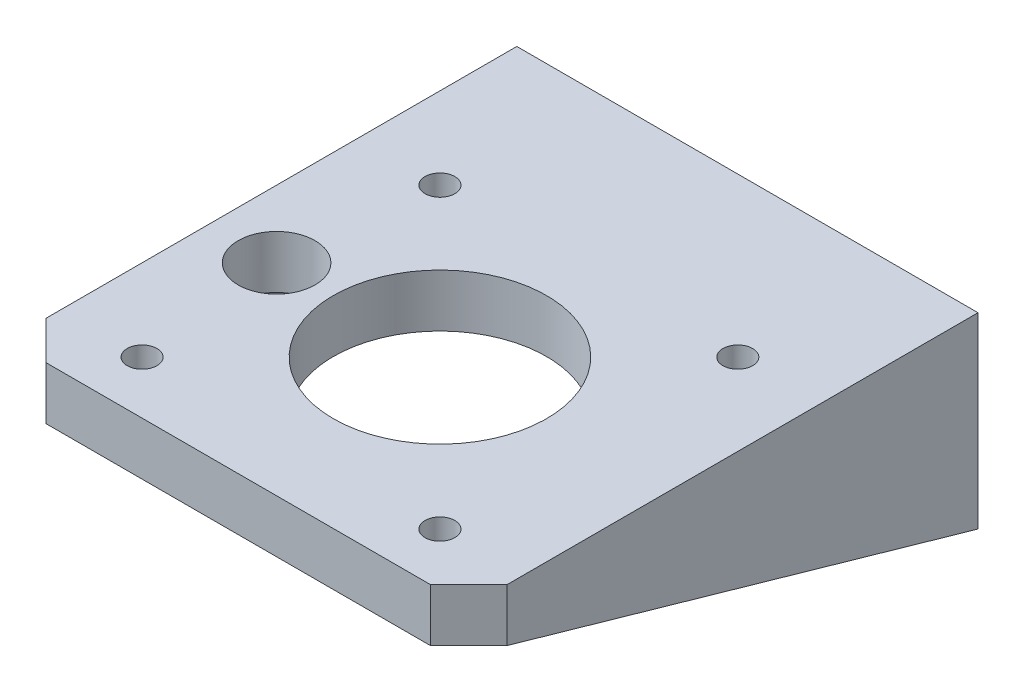
ISO-10303-21;
HEADER;
FILE_DESCRIPTION(('STEP AP214'),'2;1');
FILE_NAME('part.step','',(''),(''),'','','');
FILE_SCHEMA(('AUTOMOTIVE_DESIGN { 1 0 10303 214 1 1 1 1 }'));
ENDSEC;
DATA;
#1=APPLICATION_CONTEXT('core data for automotive mechanical design processes');
#2=APPLICATION_PROTOCOL_DEFINITION('international standard','automotive_design',2000,#1);
#3=PRODUCT_CONTEXT('',#1,'mechanical');
#4=PRODUCT('Part','Part','',(#3));
#5=PRODUCT_RELATED_PRODUCT_CATEGORY('part','',(#4));
#6=PRODUCT_DEFINITION_FORMATION('','',#4);
#7=PRODUCT_DEFINITION_CONTEXT('part definition',#1,'design');
#8=PRODUCT_DEFINITION('design','',#6,#7);
#9=PRODUCT_DEFINITION_SHAPE('','',#8);
#10=(LENGTH_UNIT() NAMED_UNIT(*) SI_UNIT(.MILLI.,.METRE.));
#11=(NAMED_UNIT(*) PLANE_ANGLE_UNIT() SI_UNIT($,.RADIAN.));
#12=(NAMED_UNIT(*) SI_UNIT($,.STERADIAN.) SOLID_ANGLE_UNIT());
#13=UNCERTAINTY_MEASURE_WITH_UNIT(LENGTH_MEASURE(1.E-05),#10,'distance_accuracy_value','');
#14=(GEOMETRIC_REPRESENTATION_CONTEXT(3) GLOBAL_UNCERTAINTY_ASSIGNED_CONTEXT((#13)) GLOBAL_UNIT_ASSIGNED_CONTEXT((#10,
#11,#12)) REPRESENTATION_CONTEXT('',''));
#15=CARTESIAN_POINT('',(0.,0.,0.));
#16=DIRECTION('',(0.,0.,1.));
#17=DIRECTION('',(1.,0.,0.));
#18=AXIS2_PLACEMENT_3D('',#15,#16,#17);
#19=CARTESIAN_POINT('',(-39.,-5.71428571428571,-57.3840620433566));
#20=DIRECTION('',(0.,0.,1.));
#21=DIRECTION('',(-1.,0.,0.));
#22=AXIS2_PLACEMENT_3D('',#19,#20,#21);
#23=CYLINDRICAL_SURFACE('',#22,1.55);
#24=CARTESIAN_POINT('',(-39.,-5.71428571428571,-53.));
#25=DIRECTION('',(0.,0.,-1.));
#26=DIRECTION('',(-1.,0.,0.));
#27=AXIS2_PLACEMENT_3D('',#24,#25,#26);
#28=CIRCLE('',#27,1.55);
#29=CARTESIAN_POINT('',(-40.55,-5.71428571428571,-53.));
#30=VERTEX_POINT('',#29);
#31=EDGE_CURVE('E319',#30,#30,#28,.F.);
#32=ORIENTED_EDGE('',*,*,#31,.F.);
#33=EDGE_LOOP('',(#32));
#34=FACE_BOUND('',#33,.T.);
#35=CARTESIAN_POINT('',(-39.,-5.71428571428571,-47.));
#36=DIRECTION('',(0.,0.,-1.));
#37=DIRECTION('',(-1.,0.,0.));
#38=AXIS2_PLACEMENT_3D('',#35,#36,#37);
#39=CIRCLE('',#38,1.55);
#40=CARTESIAN_POINT('',(-40.55,-5.71428571428571,-47.));
#41=VERTEX_POINT('',#40);
#42=EDGE_CURVE('E338',#41,#41,#39,.F.);
#43=ORIENTED_EDGE('',*,*,#42,.T.);
#44=EDGE_LOOP('',(#43));
#45=FACE_BOUND('',#44,.T.);
#46=ADVANCED_FACE('F35',(#34,#45),#23,.F.);
#47=CARTESIAN_POINT('',(-9.,-5.71428571428571,-57.3840620433566));
#48=DIRECTION('',(0.,0.,1.));
#49=DIRECTION('',(-1.,0.,0.));
#50=AXIS2_PLACEMENT_3D('',#47,#48,#49);
#51=CYLINDRICAL_SURFACE('',#50,1.55);
#52=CARTESIAN_POINT('',(-9.,-5.71428571428571,-53.));
#53=DIRECTION('',(0.,0.,-1.));
#54=DIRECTION('',(-1.,0.,0.));
#55=AXIS2_PLACEMENT_3D('',#52,#53,#54);
#56=CIRCLE('',#55,1.55);
#57=CARTESIAN_POINT('',(-10.55,-5.71428571428571,-53.));
#58=VERTEX_POINT('',#57);
#59=EDGE_CURVE('E145',#58,#58,#56,.F.);
#60=ORIENTED_EDGE('',*,*,#59,.F.);
#61=EDGE_LOOP('',(#60));
#62=FACE_BOUND('',#61,.T.);
#63=CARTESIAN_POINT('',(-9.,-5.71428571428571,-47.));
#64=DIRECTION('',(0.,0.,-1.));
#65=DIRECTION('',(-1.,0.,0.));
#66=AXIS2_PLACEMENT_3D('',#63,#64,#65);
#67=CIRCLE('',#66,1.55);
#68=CARTESIAN_POINT('',(-10.55,-5.71428571428571,-47.));
#69=VERTEX_POINT('',#68);
#70=EDGE_CURVE('E330',#69,#69,#67,.F.);
#71=ORIENTED_EDGE('',*,*,#70,.T.);
#72=EDGE_LOOP('',(#71));
#73=FACE_BOUND('',#72,.T.);
#74=ADVANCED_FACE('F258',(#62,#73),#51,.F.);
#75=CARTESIAN_POINT('',(0.,0.,0.));
#76=DIRECTION('',(0.,-1.,0.));
#77=DIRECTION('',(0.,0.,-1.));
#78=AXIS2_PLACEMENT_3D('',#75,#76,#77);
#79=PLANE('',#78);
#80=CARTESIAN_POINT('',(-24.,0.,-21.));
#81=DIRECTION('',(0.,-1.,0.));
#82=DIRECTION('',(0.,0.,1.));
#83=AXIS2_PLACEMENT_3D('',#80,#81,#82);
#84=CIRCLE('',#83,11.1);
#85=CARTESIAN_POINT('',(-24.,0.,-9.89999999999999));
#86=VERTEX_POINT('',#85);
#87=EDGE_CURVE('E173',#86,#86,#84,.T.);
#88=ORIENTED_EDGE('',*,*,#87,.F.);
#89=EDGE_LOOP('',(#88));
#90=FACE_BOUND('',#89,.T.);
#91=CARTESIAN_POINT('',(-8.5,0.,-5.5));
#92=DIRECTION('',(0.,-1.,0.));
#93=DIRECTION('',(0.,0.,1.));
#94=AXIS2_PLACEMENT_3D('',#91,#92,#93);
#95=CIRCLE('',#94,1.55);
#96=CARTESIAN_POINT('',(-8.5,0.,-3.95));
#97=VERTEX_POINT('',#96);
#98=EDGE_CURVE('E184',#97,#97,#95,.T.);
#99=ORIENTED_EDGE('',*,*,#98,.F.);
#100=EDGE_LOOP('',(#99));
#101=FACE_BOUND('',#100,.T.);
#102=CARTESIAN_POINT('',(-8.5,0.,-36.5));
#103=DIRECTION('',(0.,-1.,0.));
#104=DIRECTION('',(0.,0.,1.));
#105=AXIS2_PLACEMENT_3D('',#102,#103,#104);
#106=CIRCLE('',#105,1.55);
#107=CARTESIAN_POINT('',(-8.5,0.,-34.95));
#108=VERTEX_POINT('',#107);
#109=EDGE_CURVE('E196',#108,#108,#106,.T.);
#110=ORIENTED_EDGE('',*,*,#109,.F.);
#111=EDGE_LOOP('',(#110));
#112=FACE_BOUND('',#111,.T.);
#113=CARTESIAN_POINT('',(-39.5,0.,-36.5));
#114=DIRECTION('',(0.,-1.,0.));
#115=DIRECTION('',(0.,0.,1.));
#116=AXIS2_PLACEMENT_3D('',#113,#114,#115);
#117=CIRCLE('',#116,1.55);
#118=CARTESIAN_POINT('',(-39.5,0.,-34.95));
#119=VERTEX_POINT('',#118);
#120=EDGE_CURVE('E190',#119,#119,#117,.T.);
#121=ORIENTED_EDGE('',*,*,#120,.F.);
#122=EDGE_LOOP('',(#121));
#123=FACE_BOUND('',#122,.T.);
#124=CARTESIAN_POINT('',(-39.5,0.,-5.5));
#125=DIRECTION('',(0.,-1.,0.));
#126=DIRECTION('',(0.,0.,1.));
#127=AXIS2_PLACEMENT_3D('',#124,#125,#126);
#128=CIRCLE('',#127,1.55);
#129=CARTESIAN_POINT('',(-39.5,0.,-3.95));
#130=VERTEX_POINT('',#129);
#131=EDGE_CURVE('E178',#130,#130,#128,.T.);
#132=ORIENTED_EDGE('',*,*,#131,.F.);
#133=EDGE_LOOP('',(#132));
#134=FACE_BOUND('',#133,.T.);
#135=DIRECTION('',(0.,0.,-1.));
#136=VECTOR('',#135,1.);
#137=CARTESIAN_POINT('',(-3.,0.,0.));
#138=LINE('',#137,#136);
#139=CARTESIAN_POINT('',(-3.,0.,-4.));
#140=VERTEX_POINT('',#139);
#141=CARTESIAN_POINT('',(-3.,0.,-44.));
#142=VERTEX_POINT('',#141);
#143=EDGE_CURVE('E165',#140,#142,#138,.T.);
#144=ORIENTED_EDGE('',*,*,#143,.F.);
#145=DIRECTION('',(1.,0.,0.));
#146=VECTOR('',#145,1.);
#147=CARTESIAN_POINT('',(-3.,0.,-4.));
#148=LINE('',#147,#146);
#149=CARTESIAN_POINT('',(0.,0.,-4.));
#150=VERTEX_POINT('',#149);
#151=EDGE_CURVE('E162',#140,#150,#148,.T.);
#152=ORIENTED_EDGE('',*,*,#151,.T.);
#153=DIRECTION('',(-0.707106781186547,0.,0.707106781186548));
#154=VECTOR('',#153,1.);
#155=CARTESIAN_POINT('',(-4.,0.,0.));
#156=LINE('',#155,#154);
#157=CARTESIAN_POINT('',(-4.,0.,0.));
#158=VERTEX_POINT('',#157);
#159=EDGE_CURVE('E202',#150,#158,#156,.T.);
#160=ORIENTED_EDGE('',*,*,#159,.T.);
#161=DIRECTION('',(-1.,0.,0.));
#162=VECTOR('',#161,1.);
#163=CARTESIAN_POINT('',(-44.,0.,0.));
#164=LINE('',#163,#162);
#165=CARTESIAN_POINT('',(-44.,0.,0.));
#166=VERTEX_POINT('',#165);
#167=EDGE_CURVE('E222',#158,#166,#164,.T.);
#168=ORIENTED_EDGE('',*,*,#167,.T.);
#169=DIRECTION('',(-0.707106781186547,0.,-0.707106781186548));
#170=VECTOR('',#169,1.);
#171=CARTESIAN_POINT('',(-48.,0.,-4.));
#172=LINE('',#171,#170);
#173=CARTESIAN_POINT('',(-48.,0.,-4.00000000000001));
#174=VERTEX_POINT('',#173);
#175=EDGE_CURVE('E208',#166,#174,#172,.T.);
#176=ORIENTED_EDGE('',*,*,#175,.T.);
#177=DIRECTION('',(-1.,0.,0.));
#178=VECTOR('',#177,1.);
#179=CARTESIAN_POINT('',(-45.,0.,-4.00000000000001));
#180=LINE('',#179,#178);
#181=CARTESIAN_POINT('',(-45.,0.,-4.00000000000001));
#182=VERTEX_POINT('',#181);
#183=EDGE_CURVE('E134',#182,#174,#180,.T.);
#184=ORIENTED_EDGE('',*,*,#183,.F.);
#185=DIRECTION('',(0.,0.,1.));
#186=VECTOR('',#185,1.);
#187=CARTESIAN_POINT('',(-45.,0.,0.));
#188=LINE('',#187,#186);
#189=CARTESIAN_POINT('',(-45.,0.,-21.));
#190=VERTEX_POINT('',#189);
#191=EDGE_CURVE('E132',#190,#182,#188,.T.);
#192=ORIENTED_EDGE('',*,*,#191,.F.);
#193=CARTESIAN_POINT('',(-41.,0.,-21.));
#194=DIRECTION('',(0.,-1.,0.));
#195=DIRECTION('',(0.,0.,1.));
#196=AXIS2_PLACEMENT_3D('',#193,#194,#195);
#197=CIRCLE('',#196,4.00000000000001);
#198=EDGE_CURVE('E151',#190,#190,#197,.T.);
#199=ORIENTED_EDGE('',*,*,#198,.F.);
#200=CARTESIAN_POINT('',(-45.,0.,-44.));
#201=VERTEX_POINT('',#200);
#202=EDGE_CURVE('E148',#201,#190,#188,.T.);
#203=ORIENTED_EDGE('',*,*,#202,.F.);
#204=DIRECTION('',(1.,0.,0.));
#205=VECTOR('',#204,1.);
#206=CARTESIAN_POINT('',(-3.,0.,-44.));
#207=LINE('',#206,#205);
#208=EDGE_CURVE('E139',#201,#142,#207,.T.);
#209=ORIENTED_EDGE('',*,*,#208,.T.);
#210=EDGE_LOOP('',(#144,#152,#160,#168,#176,#184,#192,#199,#203,#209));
#211=FACE_BOUND('',#210,.T.);
#212=ADVANCED_FACE('F149',(#90,#101,#112,#123,#134,#211),#79,.T.);
#213=CARTESIAN_POINT('',(-3.,0.,0.));
#214=DIRECTION('',(1.,0.,0.));
#215=DIRECTION('',(0.,0.,1.));
#216=AXIS2_PLACEMENT_3D('',#213,#214,#215);
#217=PLANE('',#216);
#218=DIRECTION('',(0.,1.,0.));
#219=VECTOR('',#218,1.);
#220=CARTESIAN_POINT('',(-3.,-14.,-44.));
#221=LINE('',#220,#219);
#222=CARTESIAN_POINT('',(-3.,-11.4285714285714,-44.));
#223=VERTEX_POINT('',#222);
#224=EDGE_CURVE('E141',#223,#142,#221,.T.);
#225=ORIENTED_EDGE('',*,*,#224,.F.);
#226=DIRECTION('',(0.,0.274721127897378,0.961523947640823));
#227=VECTOR('',#226,1.);
#228=CARTESIAN_POINT('',(-3.,-14.,-53.));
#229=LINE('',#228,#227);
#230=EDGE_CURVE('E122',#223,#140,#229,.T.);
#231=ORIENTED_EDGE('',*,*,#230,.T.);
#232=ORIENTED_EDGE('',*,*,#143,.T.);
#233=EDGE_LOOP('',(#225,#231,#232));
#234=FACE_BOUND('',#233,.T.);
#235=ADVANCED_FACE('F277',(#234),#217,.F.);
#236=CARTESIAN_POINT('',(-45.,0.,0.));
#237=DIRECTION('',(-1.,0.,0.));
#238=DIRECTION('',(0.,0.,-1.));
#239=AXIS2_PLACEMENT_3D('',#236,#237,#238);
#240=PLANE('',#239);
#241=DIRECTION('',(0.,1.,0.));
#242=VECTOR('',#241,1.);
#243=CARTESIAN_POINT('',(-45.,0.,-44.));
#244=LINE('',#243,#242);
#245=CARTESIAN_POINT('',(-45.,-11.4285714285714,-44.));
#246=VERTEX_POINT('',#245);
#247=EDGE_CURVE('E11',#246,#201,#244,.T.);
#248=ORIENTED_EDGE('',*,*,#247,.T.);
#249=ORIENTED_EDGE('',*,*,#202,.T.);
#250=ORIENTED_EDGE('',*,*,#191,.T.);
#251=DIRECTION('',(0.,-0.274721127897378,-0.961523947640823));
#252=VECTOR('',#251,1.);
#253=CARTESIAN_POINT('',(-45.,-14.,-53.));
#254=LINE('',#253,#252);
#255=EDGE_CURVE('E120',#182,#246,#254,.T.);
#256=ORIENTED_EDGE('',*,*,#255,.T.);
#257=EDGE_LOOP('',(#248,#249,#250,#256));
#258=FACE_BOUND('',#257,.T.);
#259=ADVANCED_FACE('F129',(#258),#240,.F.);
#260=CARTESIAN_POINT('',(0.,5.5,0.));
#261=DIRECTION('',(0.,-1.,0.));
#262=DIRECTION('',(0.,0.,-1.));
#263=AXIS2_PLACEMENT_3D('',#260,#261,#262);
#264=PLANE('',#263);
#265=CARTESIAN_POINT('',(-41.,5.5,-21.));
#266=DIRECTION('',(0.,-1.,0.));
#267=DIRECTION('',(0.,0.,1.));
#268=AXIS2_PLACEMENT_3D('',#265,#266,#267);
#269=CIRCLE('',#268,4.00000000000001);
#270=CARTESIAN_POINT('',(-41.,5.5,-17.));
#271=VERTEX_POINT('',#270);
#272=EDGE_CURVE('E170',#271,#271,#269,.T.);
#273=ORIENTED_EDGE('',*,*,#272,.T.);
#274=EDGE_LOOP('',(#273));
#275=FACE_BOUND('',#274,.T.);
#276=DIRECTION('',(-0.707106781186547,0.,-0.707106781186548));
#277=VECTOR('',#276,1.);
#278=CARTESIAN_POINT('',(-48.,5.5,-4.));
#279=LINE('',#278,#277);
#280=CARTESIAN_POINT('',(-44.,5.5,0.));
#281=VERTEX_POINT('',#280);
#282=CARTESIAN_POINT('',(-48.,5.5,-4.));
#283=VERTEX_POINT('',#282);
#284=EDGE_CURVE('E212',#281,#283,#279,.T.);
#285=ORIENTED_EDGE('',*,*,#284,.F.);
#286=DIRECTION('',(-1.,0.,0.));
#287=VECTOR('',#286,1.);
#288=CARTESIAN_POINT('',(-44.,5.5,0.));
#289=LINE('',#288,#287);
#290=CARTESIAN_POINT('',(-4.,5.5,0.));
#291=VERTEX_POINT('',#290);
#292=EDGE_CURVE('E210',#291,#281,#289,.T.);
#293=ORIENTED_EDGE('',*,*,#292,.F.);
#294=DIRECTION('',(-0.707106781186547,0.,0.707106781186548));
#295=VECTOR('',#294,1.);
#296=CARTESIAN_POINT('',(-4.,5.5,0.));
#297=LINE('',#296,#295);
#298=CARTESIAN_POINT('',(0.,5.5,-4.));
#299=VERTEX_POINT('',#298);
#300=EDGE_CURVE('E207',#299,#291,#297,.T.);
#301=ORIENTED_EDGE('',*,*,#300,.F.);
#302=DIRECTION('',(0.,0.,1.));
#303=VECTOR('',#302,1.);
#304=CARTESIAN_POINT('',(0.,5.5,-4.));
#305=LINE('',#304,#303);
#306=CARTESIAN_POINT('',(0.,5.5,-53.));
#307=VERTEX_POINT('',#306);
#308=EDGE_CURVE('E205',#307,#299,#305,.T.);
#309=ORIENTED_EDGE('',*,*,#308,.F.);
#310=DIRECTION('',(1.,0.,0.));
#311=VECTOR('',#310,1.);
#312=CARTESIAN_POINT('',(-4.,5.5,-53.));
#313=LINE('',#312,#311);
#314=CARTESIAN_POINT('',(-48.,5.5,-53.));
#315=VERTEX_POINT('',#314);
#316=EDGE_CURVE('E217',#315,#307,#313,.T.);
#317=ORIENTED_EDGE('',*,*,#316,.F.);
#318=DIRECTION('',(0.,0.,-1.));
#319=VECTOR('',#318,1.);
#320=CARTESIAN_POINT('',(-48.,5.5,-49.));
#321=LINE('',#320,#319);
#322=EDGE_CURVE('E215',#283,#315,#321,.T.);
#323=ORIENTED_EDGE('',*,*,#322,.F.);
#324=EDGE_LOOP('',(#285,#293,#301,#309,#317,#323));
#325=FACE_BOUND('',#324,.T.);
#326=CARTESIAN_POINT('',(-8.5,5.5,-36.5));
#327=DIRECTION('',(0.,-1.,0.));
#328=DIRECTION('',(0.,0.,1.));
#329=AXIS2_PLACEMENT_3D('',#326,#327,#328);
#330=CIRCLE('',#329,1.55);
#331=CARTESIAN_POINT('',(-8.5,5.5,-34.95));
#332=VERTEX_POINT('',#331);
#333=EDGE_CURVE('E199',#332,#332,#330,.T.);
#334=ORIENTED_EDGE('',*,*,#333,.T.);
#335=EDGE_LOOP('',(#334));
#336=FACE_BOUND('',#335,.T.);
#337=CARTESIAN_POINT('',(-39.5,5.5,-36.5));
#338=DIRECTION('',(0.,-1.,0.));
#339=DIRECTION('',(0.,0.,1.));
#340=AXIS2_PLACEMENT_3D('',#337,#338,#339);
#341=CIRCLE('',#340,1.55);
#342=CARTESIAN_POINT('',(-39.5,5.5,-34.95));
#343=VERTEX_POINT('',#342);
#344=EDGE_CURVE('E193',#343,#343,#341,.T.);
#345=ORIENTED_EDGE('',*,*,#344,.T.);
#346=EDGE_LOOP('',(#345));
#347=FACE_BOUND('',#346,.T.);
#348=CARTESIAN_POINT('',(-8.5,5.5,-5.5));
#349=DIRECTION('',(0.,-1.,0.));
#350=DIRECTION('',(0.,0.,1.));
#351=AXIS2_PLACEMENT_3D('',#348,#349,#350);
#352=CIRCLE('',#351,1.55);
#353=CARTESIAN_POINT('',(-8.5,5.5,-3.95));
#354=VERTEX_POINT('',#353);
#355=EDGE_CURVE('E187',#354,#354,#352,.T.);
#356=ORIENTED_EDGE('',*,*,#355,.T.);
#357=EDGE_LOOP('',(#356));
#358=FACE_BOUND('',#357,.T.);
#359=CARTESIAN_POINT('',(-39.5,5.5,-5.5));
#360=DIRECTION('',(0.,-1.,0.));
#361=DIRECTION('',(0.,0.,1.));
#362=AXIS2_PLACEMENT_3D('',#359,#360,#361);
#363=CIRCLE('',#362,1.55);
#364=CARTESIAN_POINT('',(-39.5,5.5,-3.95));
#365=VERTEX_POINT('',#364);
#366=EDGE_CURVE('E181',#365,#365,#363,.T.);
#367=ORIENTED_EDGE('',*,*,#366,.T.);
#368=EDGE_LOOP('',(#367));
#369=FACE_BOUND('',#368,.T.);
#370=CARTESIAN_POINT('',(-24.,5.5,-21.));
#371=DIRECTION('',(0.,-1.,0.));
#372=DIRECTION('',(0.,0.,1.));
#373=AXIS2_PLACEMENT_3D('',#370,#371,#372);
#374=CIRCLE('',#373,11.1);
#375=CARTESIAN_POINT('',(-24.,5.5,-9.89999999999999));
#376=VERTEX_POINT('',#375);
#377=EDGE_CURVE('E175',#376,#376,#374,.T.);
#378=ORIENTED_EDGE('',*,*,#377,.T.);
#379=EDGE_LOOP('',(#378));
#380=FACE_BOUND('',#379,.T.);
#381=ADVANCED_FACE('F242',(#275,#325,#336,#347,#358,#369,#380),#264,.F.);
#382=CARTESIAN_POINT('',(0.,5.5,-4.));
#383=DIRECTION('',(-1.,0.,0.));
#384=DIRECTION('',(0.,0.,-1.));
#385=AXIS2_PLACEMENT_3D('',#382,#383,#384);
#386=PLANE('',#385);
#387=DIRECTION('',(0.,1.,0.));
#388=VECTOR('',#387,1.);
#389=CARTESIAN_POINT('',(0.,0.,-53.));
#390=LINE('',#389,#388);
#391=CARTESIAN_POINT('',(0.,-14.,-53.));
#392=VERTEX_POINT('',#391);
#393=EDGE_CURVE('E168',#392,#307,#390,.T.);
#394=ORIENTED_EDGE('',*,*,#393,.T.);
#395=ORIENTED_EDGE('',*,*,#308,.T.);
#396=DIRECTION('',(0.,-1.,0.));
#397=VECTOR('',#396,1.);
#398=CARTESIAN_POINT('',(0.,5.5,-4.));
#399=LINE('',#398,#397);
#400=EDGE_CURVE('E44',#299,#150,#399,.T.);
#401=ORIENTED_EDGE('',*,*,#400,.T.);
#402=DIRECTION('',(0.,0.274721127897378,0.961523947640823));
#403=VECTOR('',#402,1.);
#404=CARTESIAN_POINT('',(0.,-14.,-53.));
#405=LINE('',#404,#403);
#406=EDGE_CURVE('E154',#392,#150,#405,.T.);
#407=ORIENTED_EDGE('',*,*,#406,.F.);
#408=EDGE_LOOP('',(#394,#395,#401,#407));
#409=FACE_BOUND('',#408,.T.);
#410=ADVANCED_FACE('F37',(#409),#386,.F.);
#411=CARTESIAN_POINT('',(-4.,5.5,0.));
#412=DIRECTION('',(-0.707106781186548,0.,-0.707106781186547));
#413=DIRECTION('',(0.707106781186547,0.,-0.707106781186548));
#414=AXIS2_PLACEMENT_3D('',#411,#412,#413);
#415=PLANE('',#414);
#416=ORIENTED_EDGE('',*,*,#159,.F.);
#417=ORIENTED_EDGE('',*,*,#400,.F.);
#418=ORIENTED_EDGE('',*,*,#300,.T.);
#419=DIRECTION('',(0.,-1.,0.));
#420=VECTOR('',#419,1.);
#421=CARTESIAN_POINT('',(-4.,5.5,0.));
#422=LINE('',#421,#420);
#423=EDGE_CURVE('E68',#291,#158,#422,.T.);
#424=ORIENTED_EDGE('',*,*,#423,.T.);
#425=EDGE_LOOP('',(#416,#417,#418,#424));
#426=FACE_BOUND('',#425,.T.);
#427=ADVANCED_FACE('F234',(#426),#415,.F.);
#428=CARTESIAN_POINT('',(-44.,5.5,0.));
#429=DIRECTION('',(0.,0.,-1.));
#430=DIRECTION('',(1.,0.,0.));
#431=AXIS2_PLACEMENT_3D('',#428,#429,#430);
#432=PLANE('',#431);
#433=ORIENTED_EDGE('',*,*,#167,.F.);
#434=ORIENTED_EDGE('',*,*,#423,.F.);
#435=ORIENTED_EDGE('',*,*,#292,.T.);
#436=DIRECTION('',(0.,-1.,0.));
#437=VECTOR('',#436,1.);
#438=CARTESIAN_POINT('',(-44.,5.5,0.));
#439=LINE('',#438,#437);
#440=EDGE_CURVE('E74',#281,#166,#439,.T.);
#441=ORIENTED_EDGE('',*,*,#440,.T.);
#442=EDGE_LOOP('',(#433,#434,#435,#441));
#443=FACE_BOUND('',#442,.T.);
#444=ADVANCED_FACE('F245',(#443),#432,.F.);
#445=CARTESIAN_POINT('',(-48.,5.5,-4.));
#446=DIRECTION('',(0.707106781186548,0.,-0.707106781186547));
#447=DIRECTION('',(0.707106781186547,0.,0.707106781186548));
#448=AXIS2_PLACEMENT_3D('',#445,#446,#447);
#449=PLANE('',#448);
#450=ORIENTED_EDGE('',*,*,#175,.F.);
#451=ORIENTED_EDGE('',*,*,#440,.F.);
#452=ORIENTED_EDGE('',*,*,#284,.T.);
#453=DIRECTION('',(0.,-1.,0.));
#454=VECTOR('',#453,1.);
#455=CARTESIAN_POINT('',(-48.,5.5,-4.));
#456=LINE('',#455,#454);
#457=EDGE_CURVE('E52',#283,#174,#456,.T.);
#458=ORIENTED_EDGE('',*,*,#457,.T.);
#459=EDGE_LOOP('',(#450,#451,#452,#458));
#460=FACE_BOUND('',#459,.T.);
#461=ADVANCED_FACE('F247',(#460),#449,.F.);
#462=CARTESIAN_POINT('',(-48.,5.5,-49.));
#463=DIRECTION('',(1.,0.,0.));
#464=DIRECTION('',(0.,0.,1.));
#465=AXIS2_PLACEMENT_3D('',#462,#463,#464);
#466=PLANE('',#465);
#467=ORIENTED_EDGE('',*,*,#457,.F.);
#468=ORIENTED_EDGE('',*,*,#322,.T.);
#469=DIRECTION('',(0.,1.,0.));
#470=VECTOR('',#469,1.);
#471=CARTESIAN_POINT('',(-48.,0.,-53.));
#472=LINE('',#471,#470);
#473=CARTESIAN_POINT('',(-48.,-14.,-53.));
#474=VERTEX_POINT('',#473);
#475=EDGE_CURVE('E152',#474,#315,#472,.T.);
#476=ORIENTED_EDGE('',*,*,#475,.F.);
#477=DIRECTION('',(0.,-0.274721127897378,-0.961523947640823));
#478=VECTOR('',#477,1.);
#479=CARTESIAN_POINT('',(-48.,-14.,-53.));
#480=LINE('',#479,#478);
#481=EDGE_CURVE('E135',#174,#474,#480,.T.);
#482=ORIENTED_EDGE('',*,*,#481,.F.);
#483=EDGE_LOOP('',(#467,#468,#476,#482));
#484=FACE_BOUND('',#483,.T.);
#485=ADVANCED_FACE('F249',(#484),#466,.F.);
#486=CARTESIAN_POINT('',(-4.,5.5,-53.));
#487=DIRECTION('',(0.,0.,1.));
#488=DIRECTION('',(-1.,0.,0.));
#489=AXIS2_PLACEMENT_3D('',#486,#487,#488);
#490=PLANE('',#489);
#491=ORIENTED_EDGE('',*,*,#31,.T.);
#492=EDGE_LOOP('',(#491));
#493=FACE_BOUND('',#492,.T.);
#494=ORIENTED_EDGE('',*,*,#59,.T.);
#495=EDGE_LOOP('',(#494));
#496=FACE_BOUND('',#495,.T.);
#497=ORIENTED_EDGE('',*,*,#475,.T.);
#498=ORIENTED_EDGE('',*,*,#316,.T.);
#499=ORIENTED_EDGE('',*,*,#393,.F.);
#500=DIRECTION('',(1.,0.,0.));
#501=VECTOR('',#500,1.);
#502=CARTESIAN_POINT('',(-3.,-14.,-53.));
#503=LINE('',#502,#501);
#504=EDGE_CURVE('E160',#474,#392,#503,.T.);
#505=ORIENTED_EDGE('',*,*,#504,.F.);
#506=EDGE_LOOP('',(#497,#498,#499,#505));
#507=FACE_BOUND('',#506,.T.);
#508=ADVANCED_FACE('F238',(#493,#496,#507),#490,.F.);
#509=CARTESIAN_POINT('',(-8.5,5.5,-36.5));
#510=DIRECTION('',(0.,-1.,0.));
#511=DIRECTION('',(0.,0.,-1.));
#512=AXIS2_PLACEMENT_3D('',#509,#510,#511);
#513=CYLINDRICAL_SURFACE('',#512,1.55);
#514=ORIENTED_EDGE('',*,*,#333,.F.);
#515=EDGE_LOOP('',(#514));
#516=FACE_BOUND('',#515,.T.);
#517=ORIENTED_EDGE('',*,*,#109,.T.);
#518=EDGE_LOOP('',(#517));
#519=FACE_BOUND('',#518,.T.);
#520=ADVANCED_FACE('F302',(#516,#519),#513,.F.);
#521=CARTESIAN_POINT('',(-39.5,5.5,-36.5));
#522=DIRECTION('',(0.,-1.,0.));
#523=DIRECTION('',(0.,0.,-1.));
#524=AXIS2_PLACEMENT_3D('',#521,#522,#523);
#525=CYLINDRICAL_SURFACE('',#524,1.55);
#526=ORIENTED_EDGE('',*,*,#344,.F.);
#527=EDGE_LOOP('',(#526));
#528=FACE_BOUND('',#527,.T.);
#529=ORIENTED_EDGE('',*,*,#120,.T.);
#530=EDGE_LOOP('',(#529));
#531=FACE_BOUND('',#530,.T.);
#532=ADVANCED_FACE('F298',(#528,#531),#525,.F.);
#533=CARTESIAN_POINT('',(-8.5,5.5,-5.5));
#534=DIRECTION('',(0.,-1.,0.));
#535=DIRECTION('',(0.,0.,-1.));
#536=AXIS2_PLACEMENT_3D('',#533,#534,#535);
#537=CYLINDRICAL_SURFACE('',#536,1.55);
#538=ORIENTED_EDGE('',*,*,#355,.F.);
#539=EDGE_LOOP('',(#538));
#540=FACE_BOUND('',#539,.T.);
#541=ORIENTED_EDGE('',*,*,#98,.T.);
#542=EDGE_LOOP('',(#541));
#543=FACE_BOUND('',#542,.T.);
#544=ADVANCED_FACE('F294',(#540,#543),#537,.F.);
#545=CARTESIAN_POINT('',(-39.5,5.5,-5.5));
#546=DIRECTION('',(0.,-1.,0.));
#547=DIRECTION('',(0.,0.,-1.));
#548=AXIS2_PLACEMENT_3D('',#545,#546,#547);
#549=CYLINDRICAL_SURFACE('',#548,1.55);
#550=ORIENTED_EDGE('',*,*,#366,.F.);
#551=EDGE_LOOP('',(#550));
#552=FACE_BOUND('',#551,.T.);
#553=ORIENTED_EDGE('',*,*,#131,.T.);
#554=EDGE_LOOP('',(#553));
#555=FACE_BOUND('',#554,.T.);
#556=ADVANCED_FACE('F290',(#552,#555),#549,.F.);
#557=CARTESIAN_POINT('',(-24.,5.5,-21.));
#558=DIRECTION('',(0.,-1.,0.));
#559=DIRECTION('',(0.,0.,-1.));
#560=AXIS2_PLACEMENT_3D('',#557,#558,#559);
#561=CYLINDRICAL_SURFACE('',#560,11.1);
#562=ORIENTED_EDGE('',*,*,#377,.F.);
#563=EDGE_LOOP('',(#562));
#564=FACE_BOUND('',#563,.T.);
#565=ORIENTED_EDGE('',*,*,#87,.T.);
#566=EDGE_LOOP('',(#565));
#567=FACE_BOUND('',#566,.T.);
#568=ADVANCED_FACE('F286',(#564,#567),#561,.F.);
#569=CARTESIAN_POINT('',(-41.,5.5,-21.));
#570=DIRECTION('',(0.,-1.,0.));
#571=DIRECTION('',(0.,0.,-1.));
#572=AXIS2_PLACEMENT_3D('',#569,#570,#571);
#573=CYLINDRICAL_SURFACE('',#572,4.00000000000001);
#574=ORIENTED_EDGE('',*,*,#198,.T.);
#575=EDGE_LOOP('',(#574));
#576=FACE_BOUND('',#575,.T.);
#577=ORIENTED_EDGE('',*,*,#272,.F.);
#578=EDGE_LOOP('',(#577));
#579=FACE_BOUND('',#578,.T.);
#580=ADVANCED_FACE('F283',(#576,#579),#573,.F.);
#581=CARTESIAN_POINT('',(-3.,-14.,-53.));
#582=DIRECTION('',(0.,-0.961523947640823,0.274721127897378));
#583=DIRECTION('',(0.,-0.274721127897378,-0.961523947640823));
#584=AXIS2_PLACEMENT_3D('',#581,#582,#583);
#585=PLANE('',#584);
#586=ORIENTED_EDGE('',*,*,#151,.F.);
#587=ORIENTED_EDGE('',*,*,#230,.F.);
#588=DIRECTION('',(1.,0.,0.));
#589=VECTOR('',#588,1.);
#590=CARTESIAN_POINT('',(-48.,-11.4285714285714,-44.));
#591=LINE('',#590,#589);
#592=EDGE_CURVE('E115',#246,#223,#591,.T.);
#593=ORIENTED_EDGE('',*,*,#592,.F.);
#594=ORIENTED_EDGE('',*,*,#255,.F.);
#595=ORIENTED_EDGE('',*,*,#183,.T.);
#596=ORIENTED_EDGE('',*,*,#481,.T.);
#597=ORIENTED_EDGE('',*,*,#504,.T.);
#598=ORIENTED_EDGE('',*,*,#406,.T.);
#599=EDGE_LOOP('',(#586,#587,#593,#594,#595,#596,#597,#598));
#600=FACE_BOUND('',#599,.T.);
#601=ADVANCED_FACE('F118',(#600),#585,.T.);
#602=CARTESIAN_POINT('',(-3.,-14.,-44.));
#603=DIRECTION('',(0.,0.,-1.));
#604=DIRECTION('',(1.,0.,0.));
#605=AXIS2_PLACEMENT_3D('',#602,#603,#604);
#606=PLANE('',#605);
#607=CARTESIAN_POINT('',(-39.,-5.71428571428571,-44.));
#608=DIRECTION('',(0.,0.,-1.));
#609=DIRECTION('',(-1.,0.,0.));
#610=AXIS2_PLACEMENT_3D('',#607,#608,#609);
#611=CIRCLE('',#610,2.85);
#612=CARTESIAN_POINT('',(-41.85,-5.71428571428571,-44.));
#613=VERTEX_POINT('',#612);
#614=EDGE_CURVE('E126',#613,#613,#611,.T.);
#615=ORIENTED_EDGE('',*,*,#614,.T.);
#616=EDGE_LOOP('',(#615));
#617=FACE_BOUND('',#616,.T.);
#618=CARTESIAN_POINT('',(-9.,-5.71428571428571,-44.));
#619=DIRECTION('',(0.,0.,-1.));
#620=DIRECTION('',(-1.,0.,0.));
#621=AXIS2_PLACEMENT_3D('',#618,#619,#620);
#622=CIRCLE('',#621,2.85);
#623=CARTESIAN_POINT('',(-11.85,-5.71428571428571,-44.));
#624=VERTEX_POINT('',#623);
#625=EDGE_CURVE('E327',#624,#624,#622,.T.);
#626=ORIENTED_EDGE('',*,*,#625,.T.);
#627=EDGE_LOOP('',(#626));
#628=FACE_BOUND('',#627,.T.);
#629=ORIENTED_EDGE('',*,*,#224,.T.);
#630=ORIENTED_EDGE('',*,*,#208,.F.);
#631=ORIENTED_EDGE('',*,*,#247,.F.);
#632=ORIENTED_EDGE('',*,*,#592,.T.);
#633=EDGE_LOOP('',(#629,#630,#631,#632));
#634=FACE_BOUND('',#633,.T.);
#635=ADVANCED_FACE('F137',(#617,#628,#634),#606,.F.);
#636=CARTESIAN_POINT('',(-9.,-5.71428571428571,-47.));
#637=DIRECTION('',(0.,0.,1.));
#638=DIRECTION('',(-1.,0.,0.));
#639=AXIS2_PLACEMENT_3D('',#636,#637,#638);
#640=CYLINDRICAL_SURFACE('',#639,2.85);
#641=CARTESIAN_POINT('',(-9.,-5.71428571428571,-47.));
#642=DIRECTION('',(0.,0.,-1.));
#643=DIRECTION('',(-1.,0.,0.));
#644=AXIS2_PLACEMENT_3D('',#641,#642,#643);
#645=CIRCLE('',#644,2.85);
#646=CARTESIAN_POINT('',(-11.85,-5.71428571428571,-47.));
#647=VERTEX_POINT('',#646);
#648=EDGE_CURVE('E323',#647,#647,#645,.T.);
#649=ORIENTED_EDGE('',*,*,#648,.T.);
#650=EDGE_LOOP('',(#649));
#651=FACE_BOUND('',#650,.T.);
#652=ORIENTED_EDGE('',*,*,#625,.F.);
#653=EDGE_LOOP('',(#652));
#654=FACE_BOUND('',#653,.T.);
#655=ADVANCED_FACE('F269',(#651,#654),#640,.F.);
#656=CARTESIAN_POINT('',(0.,0.,-47.));
#657=DIRECTION('',(0.,0.,1.));
#658=DIRECTION('',(-1.,0.,0.));
#659=AXIS2_PLACEMENT_3D('',#656,#657,#658);
#660=PLANE('',#659);
#661=ORIENTED_EDGE('',*,*,#70,.F.);
#662=EDGE_LOOP('',(#661));
#663=FACE_BOUND('',#662,.T.);
#664=ORIENTED_EDGE('',*,*,#648,.F.);
#665=EDGE_LOOP('',(#664));
#666=FACE_BOUND('',#665,.T.);
#667=ADVANCED_FACE('F353',(#663,#666),#660,.T.);
#668=CARTESIAN_POINT('',(-39.,-5.71428571428571,-47.));
#669=DIRECTION('',(0.,0.,1.));
#670=DIRECTION('',(-1.,0.,0.));
#671=AXIS2_PLACEMENT_3D('',#668,#669,#670);
#672=CYLINDRICAL_SURFACE('',#671,2.85);
#673=CARTESIAN_POINT('',(-39.,-5.71428571428571,-47.));
#674=DIRECTION('',(0.,0.,-1.));
#675=DIRECTION('',(-1.,0.,0.));
#676=AXIS2_PLACEMENT_3D('',#673,#674,#675);
#677=CIRCLE('',#676,2.85);
#678=CARTESIAN_POINT('',(-41.85,-5.71428571428571,-47.));
#679=VERTEX_POINT('',#678);
#680=EDGE_CURVE('E331',#679,#679,#677,.T.);
#681=ORIENTED_EDGE('',*,*,#680,.T.);
#682=EDGE_LOOP('',(#681));
#683=FACE_BOUND('',#682,.T.);
#684=ORIENTED_EDGE('',*,*,#614,.F.);
#685=EDGE_LOOP('',(#684));
#686=FACE_BOUND('',#685,.T.);
#687=ADVANCED_FACE('F347',(#683,#686),#672,.F.);
#688=CARTESIAN_POINT('',(0.,0.,-47.));
#689=DIRECTION('',(0.,0.,1.));
#690=DIRECTION('',(-1.,0.,0.));
#691=AXIS2_PLACEMENT_3D('',#688,#689,#690);
#692=PLANE('',#691);
#693=ORIENTED_EDGE('',*,*,#42,.F.);
#694=EDGE_LOOP('',(#693));
#695=FACE_BOUND('',#694,.T.);
#696=ORIENTED_EDGE('',*,*,#680,.F.);
#697=EDGE_LOOP('',(#696));
#698=FACE_BOUND('',#697,.T.);
#699=ADVANCED_FACE('F344',(#695,#698),#692,.T.);
#700=CLOSED_SHELL('',(#46,#74,#212,#235,#259,#381,#410,#427,#444,#461,#485,#508,#520,#532,#544,
#556,#568,#580,#601,#635,#655,#667,#687,#699));
#701=MANIFOLD_SOLID_BREP('B2',#700);
#702=ADVANCED_BREP_SHAPE_REPRESENTATION('',(#18,#701),#14);
#703=SHAPE_DEFINITION_REPRESENTATION(#9,#702);
ENDSEC;
END-ISO-10303-21;
